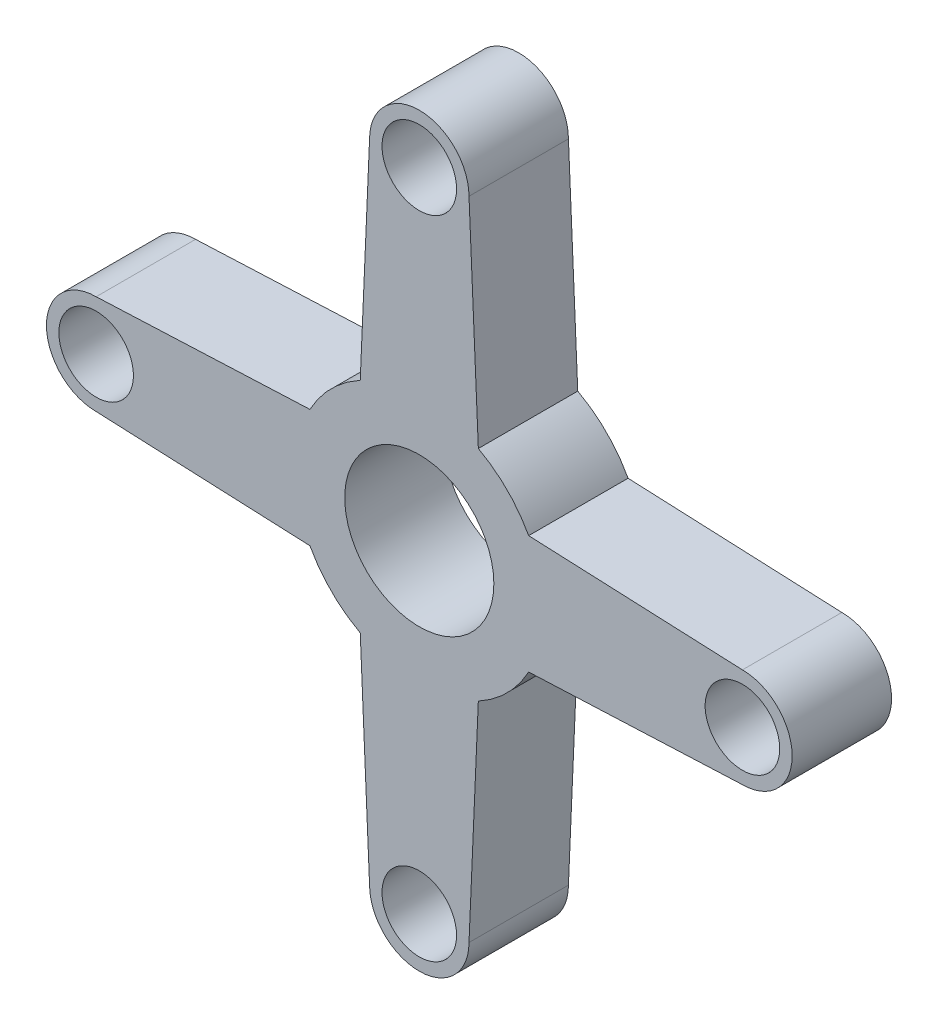
ISO-10303-21;
HEADER;
FILE_DESCRIPTION(('STEP AP214'),'2;1');
FILE_NAME('part.step','',(''),(''),'','','');
FILE_SCHEMA(('AUTOMOTIVE_DESIGN { 1 0 10303 214 1 1 1 1 }'));
ENDSEC;
DATA;
#1=APPLICATION_CONTEXT('core data for automotive mechanical design processes');
#2=APPLICATION_PROTOCOL_DEFINITION('international standard','automotive_design',2000,#1);
#3=PRODUCT_CONTEXT('',#1,'mechanical');
#4=PRODUCT('Part','Part','',(#3));
#5=PRODUCT_RELATED_PRODUCT_CATEGORY('part','',(#4));
#6=PRODUCT_DEFINITION_FORMATION('','',#4);
#7=PRODUCT_DEFINITION_CONTEXT('part definition',#1,'design');
#8=PRODUCT_DEFINITION('design','',#6,#7);
#9=PRODUCT_DEFINITION_SHAPE('','',#8);
#10=(LENGTH_UNIT() NAMED_UNIT(*) SI_UNIT(.MILLI.,.METRE.));
#11=(NAMED_UNIT(*) PLANE_ANGLE_UNIT() SI_UNIT($,.RADIAN.));
#12=(NAMED_UNIT(*) SI_UNIT($,.STERADIAN.) SOLID_ANGLE_UNIT());
#13=UNCERTAINTY_MEASURE_WITH_UNIT(LENGTH_MEASURE(1.E-05),#10,'distance_accuracy_value','');
#14=(GEOMETRIC_REPRESENTATION_CONTEXT(3) GLOBAL_UNCERTAINTY_ASSIGNED_CONTEXT((#13)) GLOBAL_UNIT_ASSIGNED_CONTEXT((#10,
#11,#12)) REPRESENTATION_CONTEXT('',''));
#15=CARTESIAN_POINT('',(0.,0.,0.));
#16=DIRECTION('',(0.,0.,1.));
#17=DIRECTION('',(1.,0.,0.));
#18=AXIS2_PLACEMENT_3D('',#15,#16,#17);
#19=CARTESIAN_POINT('',(0.,13.,4.));
#20=DIRECTION('',(0.,0.,1.));
#21=DIRECTION('',(1.,0.,0.));
#22=AXIS2_PLACEMENT_3D('',#19,#20,#21);
#23=PLANE('',#22);
#24=CARTESIAN_POINT('',(0.,-13.,4.));
#25=DIRECTION('',(0.,0.,1.));
#26=DIRECTION('',(1.,0.,0.));
#27=AXIS2_PLACEMENT_3D('',#24,#25,#26);
#28=CIRCLE('',#27,1.5);
#29=CARTESIAN_POINT('',(1.50000000000001,-13.,4.));
#30=VERTEX_POINT('',#29);
#31=EDGE_CURVE('E347',#30,#30,#28,.T.);
#32=ORIENTED_EDGE('',*,*,#31,.F.);
#33=EDGE_LOOP('',(#32));
#34=FACE_BOUND('',#33,.T.);
#35=CARTESIAN_POINT('',(0.,13.,4.));
#36=DIRECTION('',(0.,0.,1.));
#37=DIRECTION('',(1.,0.,0.));
#38=AXIS2_PLACEMENT_3D('',#35,#36,#37);
#39=CIRCLE('',#38,1.5);
#40=CARTESIAN_POINT('',(1.5,13.,4.));
#41=VERTEX_POINT('',#40);
#42=EDGE_CURVE('E359',#41,#41,#39,.T.);
#43=ORIENTED_EDGE('',*,*,#42,.F.);
#44=EDGE_LOOP('',(#43));
#45=FACE_BOUND('',#44,.T.);
#46=CARTESIAN_POINT('',(0.,13.,4.));
#47=DIRECTION('',(0.,0.,1.));
#48=DIRECTION('',(1.,0.,0.));
#49=AXIS2_PLACEMENT_3D('',#46,#47,#48);
#50=CIRCLE('',#49,2.);
#51=CARTESIAN_POINT('',(2.,13.,4.));
#52=VERTEX_POINT('',#51);
#53=CARTESIAN_POINT('',(-2.,13.,4.));
#54=VERTEX_POINT('',#53);
#55=EDGE_CURVE('E209',#52,#54,#50,.T.);
#56=ORIENTED_EDGE('',*,*,#55,.T.);
#57=DIRECTION('',(-0.043619387365329,-0.999048221581858,0.));
#58=VECTOR('',#57,1.);
#59=CARTESIAN_POINT('',(-2.,13.,4.));
#60=LINE('',#59,#58);
#61=CARTESIAN_POINT('',(-2.37549897098486,4.39965960488421,4.));
#62=VERTEX_POINT('',#61);
#63=EDGE_CURVE('E117',#54,#62,#60,.T.);
#64=ORIENTED_EDGE('',*,*,#63,.T.);
#65=CARTESIAN_POINT('',(0.,0.,4.));
#66=DIRECTION('',(0.,0.,1.));
#67=DIRECTION('',(1.,0.,0.));
#68=AXIS2_PLACEMENT_3D('',#65,#66,#67);
#69=CIRCLE('',#68,5.);
#70=CARTESIAN_POINT('',(-4.39965960488421,2.37549897098486,4.));
#71=VERTEX_POINT('',#70);
#72=EDGE_CURVE('E248',#62,#71,#69,.T.);
#73=ORIENTED_EDGE('',*,*,#72,.T.);
#74=DIRECTION('',(-0.999048221581858,-0.0436193873653292,0.));
#75=VECTOR('',#74,1.);
#76=CARTESIAN_POINT('',(-13.,2.,4.));
#77=LINE('',#76,#75);
#78=CARTESIAN_POINT('',(-13.,2.,4.));
#79=VERTEX_POINT('',#78);
#80=EDGE_CURVE('E267',#71,#79,#77,.T.);
#81=ORIENTED_EDGE('',*,*,#80,.T.);
#82=CARTESIAN_POINT('',(-13.,0.,4.));
#83=DIRECTION('',(0.,0.,1.));
#84=DIRECTION('',(1.,0.,0.));
#85=AXIS2_PLACEMENT_3D('',#82,#83,#84);
#86=CIRCLE('',#85,2.);
#87=CARTESIAN_POINT('',(-13.,-2.,4.));
#88=VERTEX_POINT('',#87);
#89=EDGE_CURVE('E264',#79,#88,#86,.T.);
#90=ORIENTED_EDGE('',*,*,#89,.T.);
#91=DIRECTION('',(0.999048221581858,-0.0436193873653288,0.));
#92=VECTOR('',#91,1.);
#93=CARTESIAN_POINT('',(-13.,-2.,4.));
#94=LINE('',#93,#92);
#95=CARTESIAN_POINT('',(-4.39965960488421,-2.37549897098486,4.));
#96=VERTEX_POINT('',#95);
#97=EDGE_CURVE('E266',#88,#96,#94,.T.);
#98=ORIENTED_EDGE('',*,*,#97,.T.);
#99=CARTESIAN_POINT('',(0.,0.,4.));
#100=DIRECTION('',(0.,0.,1.));
#101=DIRECTION('',(1.,0.,0.));
#102=AXIS2_PLACEMENT_3D('',#99,#100,#101);
#103=CIRCLE('',#102,5.);
#104=CARTESIAN_POINT('',(-2.37549897098486,-4.39965960488421,4.));
#105=VERTEX_POINT('',#104);
#106=EDGE_CURVE('E269',#96,#105,#103,.T.);
#107=ORIENTED_EDGE('',*,*,#106,.T.);
#108=DIRECTION('',(0.0436193873653291,-0.999048221581858,0.));
#109=VECTOR('',#108,1.);
#110=CARTESIAN_POINT('',(-2.,-13.,4.));
#111=LINE('',#110,#109);
#112=CARTESIAN_POINT('',(-2.,-13.,4.));
#113=VERTEX_POINT('',#112);
#114=EDGE_CURVE('E275',#105,#113,#111,.T.);
#115=ORIENTED_EDGE('',*,*,#114,.T.);
#116=CARTESIAN_POINT('',(0.,-13.,4.));
#117=DIRECTION('',(0.,0.,1.));
#118=DIRECTION('',(1.,0.,0.));
#119=AXIS2_PLACEMENT_3D('',#116,#117,#118);
#120=CIRCLE('',#119,2.);
#121=CARTESIAN_POINT('',(2.,-13.,4.));
#122=VERTEX_POINT('',#121);
#123=EDGE_CURVE('E277',#113,#122,#120,.T.);
#124=ORIENTED_EDGE('',*,*,#123,.T.);
#125=DIRECTION('',(0.0436193873653288,0.999048221581858,0.));
#126=VECTOR('',#125,1.);
#127=CARTESIAN_POINT('',(2.,-13.,4.));
#128=LINE('',#127,#126);
#129=CARTESIAN_POINT('',(2.37549897098486,-4.39965960488421,4.));
#130=VERTEX_POINT('',#129);
#131=EDGE_CURVE('E279',#122,#130,#128,.T.);
#132=ORIENTED_EDGE('',*,*,#131,.T.);
#133=CARTESIAN_POINT('',(0.,0.,4.));
#134=DIRECTION('',(0.,0.,1.));
#135=DIRECTION('',(1.,0.,0.));
#136=AXIS2_PLACEMENT_3D('',#133,#134,#135);
#137=CIRCLE('',#136,5.);
#138=CARTESIAN_POINT('',(4.39965960488421,-2.37549897098486,4.));
#139=VERTEX_POINT('',#138);
#140=EDGE_CURVE('E281',#130,#139,#137,.T.);
#141=ORIENTED_EDGE('',*,*,#140,.T.);
#142=DIRECTION('',(0.999048221581858,0.043619387365329,0.));
#143=VECTOR('',#142,1.);
#144=CARTESIAN_POINT('',(13.,-2.,4.));
#145=LINE('',#144,#143);
#146=CARTESIAN_POINT('',(13.,-2.,4.));
#147=VERTEX_POINT('',#146);
#148=EDGE_CURVE('E283',#139,#147,#145,.T.);
#149=ORIENTED_EDGE('',*,*,#148,.T.);
#150=CARTESIAN_POINT('',(13.,0.,4.));
#151=DIRECTION('',(0.,0.,1.));
#152=DIRECTION('',(1.,0.,0.));
#153=AXIS2_PLACEMENT_3D('',#150,#151,#152);
#154=CIRCLE('',#153,2.);
#155=CARTESIAN_POINT('',(13.,2.,4.));
#156=VERTEX_POINT('',#155);
#157=EDGE_CURVE('E160',#147,#156,#154,.T.);
#158=ORIENTED_EDGE('',*,*,#157,.T.);
#159=DIRECTION('',(-0.999048221581858,0.0436193873653289,0.));
#160=VECTOR('',#159,1.);
#161=CARTESIAN_POINT('',(13.,2.,4.));
#162=LINE('',#161,#160);
#163=CARTESIAN_POINT('',(4.39965960488421,2.37549897098486,4.));
#164=VERTEX_POINT('',#163);
#165=EDGE_CURVE('E154',#156,#164,#162,.T.);
#166=ORIENTED_EDGE('',*,*,#165,.T.);
#167=CARTESIAN_POINT('',(0.,0.,4.));
#168=DIRECTION('',(0.,0.,1.));
#169=DIRECTION('',(1.,0.,0.));
#170=AXIS2_PLACEMENT_3D('',#167,#168,#169);
#171=CIRCLE('',#170,5.);
#172=CARTESIAN_POINT('',(2.37549897098486,4.39965960488421,4.));
#173=VERTEX_POINT('',#172);
#174=EDGE_CURVE('E158',#164,#173,#171,.T.);
#175=ORIENTED_EDGE('',*,*,#174,.T.);
#176=DIRECTION('',(-0.0436193873653289,0.999048221581858,0.));
#177=VECTOR('',#176,1.);
#178=CARTESIAN_POINT('',(2.,13.,4.));
#179=LINE('',#178,#177);
#180=EDGE_CURVE('E50',#173,#52,#179,.T.);
#181=ORIENTED_EDGE('',*,*,#180,.T.);
#182=EDGE_LOOP('',(#56,#64,#73,#81,#90,#98,#107,#115,#124,#132,#141,#149,#158,#166,#175,#181));
#183=FACE_BOUND('',#182,.T.);
#184=CARTESIAN_POINT('',(0.,0.,4.));
#185=DIRECTION('',(0.,0.,1.));
#186=DIRECTION('',(1.,0.,0.));
#187=AXIS2_PLACEMENT_3D('',#184,#185,#186);
#188=CIRCLE('',#187,3.);
#189=CARTESIAN_POINT('',(3.,0.,4.));
#190=VERTEX_POINT('',#189);
#191=EDGE_CURVE('E182',#190,#190,#188,.T.);
#192=ORIENTED_EDGE('',*,*,#191,.F.);
#193=EDGE_LOOP('',(#192));
#194=FACE_BOUND('',#193,.T.);
#195=CARTESIAN_POINT('',(13.,0.,4.));
#196=DIRECTION('',(0.,0.,1.));
#197=DIRECTION('',(1.,0.,0.));
#198=AXIS2_PLACEMENT_3D('',#195,#196,#197);
#199=CIRCLE('',#198,1.5);
#200=CARTESIAN_POINT('',(14.5,0.,4.));
#201=VERTEX_POINT('',#200);
#202=EDGE_CURVE('E353',#201,#201,#199,.T.);
#203=ORIENTED_EDGE('',*,*,#202,.F.);
#204=EDGE_LOOP('',(#203));
#205=FACE_BOUND('',#204,.T.);
#206=CARTESIAN_POINT('',(-13.,0.,4.));
#207=DIRECTION('',(0.,0.,1.));
#208=DIRECTION('',(1.,0.,0.));
#209=AXIS2_PLACEMENT_3D('',#206,#207,#208);
#210=CIRCLE('',#209,1.5);
#211=CARTESIAN_POINT('',(-11.5,0.,4.));
#212=VERTEX_POINT('',#211);
#213=EDGE_CURVE('E338',#212,#212,#210,.T.);
#214=ORIENTED_EDGE('',*,*,#213,.F.);
#215=EDGE_LOOP('',(#214));
#216=FACE_BOUND('',#215,.T.);
#217=ADVANCED_FACE('F33',(#34,#45,#183,#194,#205,#216),#23,.T.);
#218=CARTESIAN_POINT('',(0.,13.,0.));
#219=DIRECTION('',(0.,0.,1.));
#220=DIRECTION('',(1.,0.,0.));
#221=AXIS2_PLACEMENT_3D('',#218,#219,#220);
#222=PLANE('',#221);
#223=CARTESIAN_POINT('',(0.,13.,0.));
#224=DIRECTION('',(0.,0.,1.));
#225=DIRECTION('',(1.,0.,0.));
#226=AXIS2_PLACEMENT_3D('',#223,#224,#225);
#227=CIRCLE('',#226,2.);
#228=CARTESIAN_POINT('',(2.,13.,0.));
#229=VERTEX_POINT('',#228);
#230=CARTESIAN_POINT('',(-2.,13.,0.));
#231=VERTEX_POINT('',#230);
#232=EDGE_CURVE('E178',#229,#231,#227,.T.);
#233=ORIENTED_EDGE('',*,*,#232,.F.);
#234=DIRECTION('',(-0.0436193873653289,0.999048221581858,0.));
#235=VECTOR('',#234,1.);
#236=CARTESIAN_POINT('',(2.,13.,0.));
#237=LINE('',#236,#235);
#238=CARTESIAN_POINT('',(2.37549897098486,4.39965960488421,0.));
#239=VERTEX_POINT('',#238);
#240=EDGE_CURVE('E109',#239,#229,#237,.T.);
#241=ORIENTED_EDGE('',*,*,#240,.F.);
#242=CARTESIAN_POINT('',(0.,0.,0.));
#243=DIRECTION('',(0.,0.,1.));
#244=DIRECTION('',(1.,0.,0.));
#245=AXIS2_PLACEMENT_3D('',#242,#243,#244);
#246=CIRCLE('',#245,5.);
#247=CARTESIAN_POINT('',(4.39965960488421,2.37549897098486,0.));
#248=VERTEX_POINT('',#247);
#249=EDGE_CURVE('E103',#248,#239,#246,.T.);
#250=ORIENTED_EDGE('',*,*,#249,.F.);
#251=DIRECTION('',(-0.999048221581858,0.0436193873653289,0.));
#252=VECTOR('',#251,1.);
#253=CARTESIAN_POINT('',(13.,2.,0.));
#254=LINE('',#253,#252);
#255=CARTESIAN_POINT('',(13.,2.,0.));
#256=VERTEX_POINT('',#255);
#257=EDGE_CURVE('E168',#256,#248,#254,.T.);
#258=ORIENTED_EDGE('',*,*,#257,.F.);
#259=CARTESIAN_POINT('',(13.,0.,0.));
#260=DIRECTION('',(0.,0.,1.));
#261=DIRECTION('',(1.,0.,0.));
#262=AXIS2_PLACEMENT_3D('',#259,#260,#261);
#263=CIRCLE('',#262,2.);
#264=CARTESIAN_POINT('',(13.,-2.,0.));
#265=VERTEX_POINT('',#264);
#266=EDGE_CURVE('E204',#265,#256,#263,.T.);
#267=ORIENTED_EDGE('',*,*,#266,.F.);
#268=DIRECTION('',(0.999048221581858,0.043619387365329,0.));
#269=VECTOR('',#268,1.);
#270=CARTESIAN_POINT('',(13.,-2.,0.));
#271=LINE('',#270,#269);
#272=CARTESIAN_POINT('',(4.39965960488421,-2.37549897098486,0.));
#273=VERTEX_POINT('',#272);
#274=EDGE_CURVE('E202',#273,#265,#271,.T.);
#275=ORIENTED_EDGE('',*,*,#274,.F.);
#276=CARTESIAN_POINT('',(0.,0.,0.));
#277=DIRECTION('',(0.,0.,1.));
#278=DIRECTION('',(1.,0.,0.));
#279=AXIS2_PLACEMENT_3D('',#276,#277,#278);
#280=CIRCLE('',#279,5.);
#281=CARTESIAN_POINT('',(2.37549897098486,-4.39965960488421,0.));
#282=VERTEX_POINT('',#281);
#283=EDGE_CURVE('E200',#282,#273,#280,.T.);
#284=ORIENTED_EDGE('',*,*,#283,.F.);
#285=DIRECTION('',(0.0436193873653288,0.999048221581858,0.));
#286=VECTOR('',#285,1.);
#287=CARTESIAN_POINT('',(2.,-13.,0.));
#288=LINE('',#287,#286);
#289=CARTESIAN_POINT('',(2.,-13.,0.));
#290=VERTEX_POINT('',#289);
#291=EDGE_CURVE('E198',#290,#282,#288,.T.);
#292=ORIENTED_EDGE('',*,*,#291,.F.);
#293=CARTESIAN_POINT('',(0.,-13.,0.));
#294=DIRECTION('',(0.,0.,1.));
#295=DIRECTION('',(1.,0.,0.));
#296=AXIS2_PLACEMENT_3D('',#293,#294,#295);
#297=CIRCLE('',#296,2.);
#298=CARTESIAN_POINT('',(-2.,-13.,0.));
#299=VERTEX_POINT('',#298);
#300=EDGE_CURVE('E196',#299,#290,#297,.T.);
#301=ORIENTED_EDGE('',*,*,#300,.F.);
#302=DIRECTION('',(0.0436193873653291,-0.999048221581858,0.));
#303=VECTOR('',#302,1.);
#304=CARTESIAN_POINT('',(-2.,-13.,0.));
#305=LINE('',#304,#303);
#306=CARTESIAN_POINT('',(-2.37549897098486,-4.39965960488421,0.));
#307=VERTEX_POINT('',#306);
#308=EDGE_CURVE('E194',#307,#299,#305,.T.);
#309=ORIENTED_EDGE('',*,*,#308,.F.);
#310=CARTESIAN_POINT('',(0.,0.,0.));
#311=DIRECTION('',(0.,0.,1.));
#312=DIRECTION('',(1.,0.,0.));
#313=AXIS2_PLACEMENT_3D('',#310,#311,#312);
#314=CIRCLE('',#313,5.);
#315=CARTESIAN_POINT('',(-4.39965960488421,-2.37549897098486,0.));
#316=VERTEX_POINT('',#315);
#317=EDGE_CURVE('E192',#316,#307,#314,.T.);
#318=ORIENTED_EDGE('',*,*,#317,.F.);
#319=DIRECTION('',(0.999048221581858,-0.0436193873653288,0.));
#320=VECTOR('',#319,1.);
#321=CARTESIAN_POINT('',(-13.,-2.,0.));
#322=LINE('',#321,#320);
#323=CARTESIAN_POINT('',(-13.,-2.,0.));
#324=VERTEX_POINT('',#323);
#325=EDGE_CURVE('E190',#324,#316,#322,.T.);
#326=ORIENTED_EDGE('',*,*,#325,.F.);
#327=CARTESIAN_POINT('',(-13.,0.,0.));
#328=DIRECTION('',(0.,0.,1.));
#329=DIRECTION('',(1.,0.,0.));
#330=AXIS2_PLACEMENT_3D('',#327,#328,#329);
#331=CIRCLE('',#330,2.);
#332=CARTESIAN_POINT('',(-13.,2.,0.));
#333=VERTEX_POINT('',#332);
#334=EDGE_CURVE('E188',#333,#324,#331,.T.);
#335=ORIENTED_EDGE('',*,*,#334,.F.);
#336=DIRECTION('',(-0.999048221581858,-0.0436193873653292,0.));
#337=VECTOR('',#336,1.);
#338=CARTESIAN_POINT('',(-13.,2.,0.));
#339=LINE('',#338,#337);
#340=CARTESIAN_POINT('',(-4.39965960488421,2.37549897098486,0.));
#341=VERTEX_POINT('',#340);
#342=EDGE_CURVE('E186',#341,#333,#339,.T.);
#343=ORIENTED_EDGE('',*,*,#342,.F.);
#344=CARTESIAN_POINT('',(0.,0.,0.));
#345=DIRECTION('',(0.,0.,1.));
#346=DIRECTION('',(1.,0.,0.));
#347=AXIS2_PLACEMENT_3D('',#344,#345,#346);
#348=CIRCLE('',#347,5.);
#349=CARTESIAN_POINT('',(-2.37549897098486,4.39965960488421,0.));
#350=VERTEX_POINT('',#349);
#351=EDGE_CURVE('E184',#350,#341,#348,.T.);
#352=ORIENTED_EDGE('',*,*,#351,.F.);
#353=DIRECTION('',(-0.043619387365329,-0.999048221581858,0.));
#354=VECTOR('',#353,1.);
#355=CARTESIAN_POINT('',(-2.,13.,0.));
#356=LINE('',#355,#354);
#357=EDGE_CURVE('E181',#231,#350,#356,.T.);
#358=ORIENTED_EDGE('',*,*,#357,.F.);
#359=EDGE_LOOP('',(#233,#241,#250,#258,#267,#275,#284,#292,#301,#309,#318,#326,#335,#343,#352,#358));
#360=FACE_BOUND('',#359,.T.);
#361=CARTESIAN_POINT('',(0.,0.,0.));
#362=DIRECTION('',(0.,0.,1.));
#363=DIRECTION('',(1.,0.,0.));
#364=AXIS2_PLACEMENT_3D('',#361,#362,#363);
#365=CIRCLE('',#364,3.);
#366=CARTESIAN_POINT('',(3.,0.,0.));
#367=VERTEX_POINT('',#366);
#368=EDGE_CURVE('E362',#367,#367,#365,.T.);
#369=ORIENTED_EDGE('',*,*,#368,.T.);
#370=EDGE_LOOP('',(#369));
#371=FACE_BOUND('',#370,.T.);
#372=CARTESIAN_POINT('',(0.,13.,0.));
#373=DIRECTION('',(0.,0.,1.));
#374=DIRECTION('',(1.,0.,0.));
#375=AXIS2_PLACEMENT_3D('',#372,#373,#374);
#376=CIRCLE('',#375,1.5);
#377=CARTESIAN_POINT('',(1.5,13.,0.));
#378=VERTEX_POINT('',#377);
#379=EDGE_CURVE('E356',#378,#378,#376,.T.);
#380=ORIENTED_EDGE('',*,*,#379,.T.);
#381=EDGE_LOOP('',(#380));
#382=FACE_BOUND('',#381,.T.);
#383=CARTESIAN_POINT('',(13.,0.,0.));
#384=DIRECTION('',(0.,0.,1.));
#385=DIRECTION('',(1.,0.,0.));
#386=AXIS2_PLACEMENT_3D('',#383,#384,#385);
#387=CIRCLE('',#386,1.5);
#388=CARTESIAN_POINT('',(14.5,0.,0.));
#389=VERTEX_POINT('',#388);
#390=EDGE_CURVE('E350',#389,#389,#387,.T.);
#391=ORIENTED_EDGE('',*,*,#390,.T.);
#392=EDGE_LOOP('',(#391));
#393=FACE_BOUND('',#392,.T.);
#394=CARTESIAN_POINT('',(0.,-13.,0.));
#395=DIRECTION('',(0.,0.,1.));
#396=DIRECTION('',(1.,0.,0.));
#397=AXIS2_PLACEMENT_3D('',#394,#395,#396);
#398=CIRCLE('',#397,1.5);
#399=CARTESIAN_POINT('',(1.50000000000001,-13.,0.));
#400=VERTEX_POINT('',#399);
#401=EDGE_CURVE('E344',#400,#400,#398,.T.);
#402=ORIENTED_EDGE('',*,*,#401,.T.);
#403=EDGE_LOOP('',(#402));
#404=FACE_BOUND('',#403,.T.);
#405=CARTESIAN_POINT('',(-13.,0.,0.));
#406=DIRECTION('',(0.,0.,1.));
#407=DIRECTION('',(1.,0.,0.));
#408=AXIS2_PLACEMENT_3D('',#405,#406,#407);
#409=CIRCLE('',#408,1.5);
#410=CARTESIAN_POINT('',(-11.5,0.,0.));
#411=VERTEX_POINT('',#410);
#412=EDGE_CURVE('E341',#411,#411,#409,.T.);
#413=ORIENTED_EDGE('',*,*,#412,.T.);
#414=EDGE_LOOP('',(#413));
#415=FACE_BOUND('',#414,.T.);
#416=ADVANCED_FACE('F252',(#360,#371,#382,#393,#404,#415),#222,.F.);
#417=CARTESIAN_POINT('',(0.,13.,4.));
#418=DIRECTION('',(0.,0.,-1.));
#419=DIRECTION('',(-1.,0.,0.));
#420=AXIS2_PLACEMENT_3D('',#417,#418,#419);
#421=CYLINDRICAL_SURFACE('',#420,2.);
#422=ORIENTED_EDGE('',*,*,#232,.T.);
#423=DIRECTION('',(0.,0.,-1.));
#424=VECTOR('',#423,1.);
#425=CARTESIAN_POINT('',(-2.,13.,4.));
#426=LINE('',#425,#424);
#427=EDGE_CURVE('E11',#54,#231,#426,.T.);
#428=ORIENTED_EDGE('',*,*,#427,.F.);
#429=ORIENTED_EDGE('',*,*,#55,.F.);
#430=DIRECTION('',(0.,0.,-1.));
#431=VECTOR('',#430,1.);
#432=CARTESIAN_POINT('',(2.,13.,4.));
#433=LINE('',#432,#431);
#434=EDGE_CURVE('E174',#52,#229,#433,.T.);
#435=ORIENTED_EDGE('',*,*,#434,.T.);
#436=EDGE_LOOP('',(#422,#428,#429,#435));
#437=FACE_BOUND('',#436,.T.);
#438=ADVANCED_FACE('F35',(#437),#421,.T.);
#439=CARTESIAN_POINT('',(-2.,13.,4.));
#440=DIRECTION('',(0.999048221581858,-0.043619387365329,0.));
#441=DIRECTION('',(0.043619387365329,0.999048221581858,0.));
#442=AXIS2_PLACEMENT_3D('',#439,#440,#441);
#443=PLANE('',#442);
#444=ORIENTED_EDGE('',*,*,#357,.T.);
#445=DIRECTION('',(0.,0.,-1.));
#446=VECTOR('',#445,1.);
#447=CARTESIAN_POINT('',(-2.37549897098486,4.39965960488421,4.));
#448=LINE('',#447,#446);
#449=EDGE_CURVE('E42',#62,#350,#448,.T.);
#450=ORIENTED_EDGE('',*,*,#449,.F.);
#451=ORIENTED_EDGE('',*,*,#63,.F.);
#452=ORIENTED_EDGE('',*,*,#427,.T.);
#453=EDGE_LOOP('',(#444,#450,#451,#452));
#454=FACE_BOUND('',#453,.T.);
#455=ADVANCED_FACE('F521',(#454),#443,.F.);
#456=CARTESIAN_POINT('',(0.,0.,4.));
#457=DIRECTION('',(0.,0.,-1.));
#458=DIRECTION('',(-1.,0.,0.));
#459=AXIS2_PLACEMENT_3D('',#456,#457,#458);
#460=CYLINDRICAL_SURFACE('',#459,5.);
#461=ORIENTED_EDGE('',*,*,#351,.T.);
#462=DIRECTION('',(0.,0.,-1.));
#463=VECTOR('',#462,1.);
#464=CARTESIAN_POINT('',(-4.39965960488421,2.37549897098486,4.));
#465=LINE('',#464,#463);
#466=EDGE_CURVE('E240',#71,#341,#465,.T.);
#467=ORIENTED_EDGE('',*,*,#466,.F.);
#468=ORIENTED_EDGE('',*,*,#72,.F.);
#469=ORIENTED_EDGE('',*,*,#449,.T.);
#470=EDGE_LOOP('',(#461,#467,#468,#469));
#471=FACE_BOUND('',#470,.T.);
#472=ADVANCED_FACE('F246',(#471),#460,.T.);
#473=CARTESIAN_POINT('',(-13.,2.,4.));
#474=DIRECTION('',(0.0436193873653292,-0.999048221581858,0.));
#475=DIRECTION('',(0.999048221581858,0.0436193873653292,0.));
#476=AXIS2_PLACEMENT_3D('',#473,#474,#475);
#477=PLANE('',#476);
#478=ORIENTED_EDGE('',*,*,#342,.T.);
#479=DIRECTION('',(0.,0.,-1.));
#480=VECTOR('',#479,1.);
#481=CARTESIAN_POINT('',(-13.,2.,4.));
#482=LINE('',#481,#480);
#483=EDGE_CURVE('E237',#79,#333,#482,.T.);
#484=ORIENTED_EDGE('',*,*,#483,.F.);
#485=ORIENTED_EDGE('',*,*,#80,.F.);
#486=ORIENTED_EDGE('',*,*,#466,.T.);
#487=EDGE_LOOP('',(#478,#484,#485,#486));
#488=FACE_BOUND('',#487,.T.);
#489=ADVANCED_FACE('F258',(#488),#477,.F.);
#490=CARTESIAN_POINT('',(-13.,0.,4.));
#491=DIRECTION('',(0.,0.,-1.));
#492=DIRECTION('',(-1.,0.,0.));
#493=AXIS2_PLACEMENT_3D('',#490,#491,#492);
#494=CYLINDRICAL_SURFACE('',#493,2.);
#495=ORIENTED_EDGE('',*,*,#334,.T.);
#496=DIRECTION('',(0.,0.,-1.));
#497=VECTOR('',#496,1.);
#498=CARTESIAN_POINT('',(-13.,-2.,4.));
#499=LINE('',#498,#497);
#500=EDGE_CURVE('E234',#88,#324,#499,.T.);
#501=ORIENTED_EDGE('',*,*,#500,.F.);
#502=ORIENTED_EDGE('',*,*,#89,.F.);
#503=ORIENTED_EDGE('',*,*,#483,.T.);
#504=EDGE_LOOP('',(#495,#501,#502,#503));
#505=FACE_BOUND('',#504,.T.);
#506=ADVANCED_FACE('F262',(#505),#494,.T.);
#507=CARTESIAN_POINT('',(-13.,-2.,4.));
#508=DIRECTION('',(0.0436193873653288,0.999048221581858,0.));
#509=DIRECTION('',(-0.999048221581858,0.0436193873653288,0.));
#510=AXIS2_PLACEMENT_3D('',#507,#508,#509);
#511=PLANE('',#510);
#512=ORIENTED_EDGE('',*,*,#325,.T.);
#513=DIRECTION('',(0.,0.,-1.));
#514=VECTOR('',#513,1.);
#515=CARTESIAN_POINT('',(-4.39965960488421,-2.37549897098486,4.));
#516=LINE('',#515,#514);
#517=EDGE_CURVE('E231',#96,#316,#516,.T.);
#518=ORIENTED_EDGE('',*,*,#517,.F.);
#519=ORIENTED_EDGE('',*,*,#97,.F.);
#520=ORIENTED_EDGE('',*,*,#500,.T.);
#521=EDGE_LOOP('',(#512,#518,#519,#520));
#522=FACE_BOUND('',#521,.T.);
#523=ADVANCED_FACE('F486',(#522),#511,.F.);
#524=CARTESIAN_POINT('',(0.,0.,4.));
#525=DIRECTION('',(0.,0.,-1.));
#526=DIRECTION('',(-1.,0.,0.));
#527=AXIS2_PLACEMENT_3D('',#524,#525,#526);
#528=CYLINDRICAL_SURFACE('',#527,5.);
#529=ORIENTED_EDGE('',*,*,#317,.T.);
#530=DIRECTION('',(0.,0.,-1.));
#531=VECTOR('',#530,1.);
#532=CARTESIAN_POINT('',(-2.37549897098486,-4.39965960488421,4.));
#533=LINE('',#532,#531);
#534=EDGE_CURVE('E228',#105,#307,#533,.T.);
#535=ORIENTED_EDGE('',*,*,#534,.F.);
#536=ORIENTED_EDGE('',*,*,#106,.F.);
#537=ORIENTED_EDGE('',*,*,#517,.T.);
#538=EDGE_LOOP('',(#529,#535,#536,#537));
#539=FACE_BOUND('',#538,.T.);
#540=ADVANCED_FACE('F476',(#539),#528,.T.);
#541=CARTESIAN_POINT('',(-2.,-13.,4.));
#542=DIRECTION('',(0.999048221581858,0.0436193873653291,0.));
#543=DIRECTION('',(-0.0436193873653291,0.999048221581858,0.));
#544=AXIS2_PLACEMENT_3D('',#541,#542,#543);
#545=PLANE('',#544);
#546=ORIENTED_EDGE('',*,*,#308,.T.);
#547=DIRECTION('',(0.,0.,-1.));
#548=VECTOR('',#547,1.);
#549=CARTESIAN_POINT('',(-2.,-13.,4.));
#550=LINE('',#549,#548);
#551=EDGE_CURVE('E225',#113,#299,#550,.T.);
#552=ORIENTED_EDGE('',*,*,#551,.F.);
#553=ORIENTED_EDGE('',*,*,#114,.F.);
#554=ORIENTED_EDGE('',*,*,#534,.T.);
#555=EDGE_LOOP('',(#546,#552,#553,#554));
#556=FACE_BOUND('',#555,.T.);
#557=ADVANCED_FACE('F466',(#556),#545,.F.);
#558=CARTESIAN_POINT('',(0.,-13.,4.));
#559=DIRECTION('',(0.,0.,-1.));
#560=DIRECTION('',(-1.,0.,0.));
#561=AXIS2_PLACEMENT_3D('',#558,#559,#560);
#562=CYLINDRICAL_SURFACE('',#561,2.);
#563=ORIENTED_EDGE('',*,*,#300,.T.);
#564=DIRECTION('',(0.,0.,-1.));
#565=VECTOR('',#564,1.);
#566=CARTESIAN_POINT('',(2.,-13.,4.));
#567=LINE('',#566,#565);
#568=EDGE_CURVE('E222',#122,#290,#567,.T.);
#569=ORIENTED_EDGE('',*,*,#568,.F.);
#570=ORIENTED_EDGE('',*,*,#123,.F.);
#571=ORIENTED_EDGE('',*,*,#551,.T.);
#572=EDGE_LOOP('',(#563,#569,#570,#571));
#573=FACE_BOUND('',#572,.T.);
#574=ADVANCED_FACE('F456',(#573),#562,.T.);
#575=CARTESIAN_POINT('',(2.,-13.,4.));
#576=DIRECTION('',(-0.999048221581858,0.0436193873653288,0.));
#577=DIRECTION('',(-0.0436193873653288,-0.999048221581858,0.));
#578=AXIS2_PLACEMENT_3D('',#575,#576,#577);
#579=PLANE('',#578);
#580=ORIENTED_EDGE('',*,*,#291,.T.);
#581=DIRECTION('',(0.,0.,-1.));
#582=VECTOR('',#581,1.);
#583=CARTESIAN_POINT('',(2.37549897098486,-4.39965960488421,4.));
#584=LINE('',#583,#582);
#585=EDGE_CURVE('E219',#130,#282,#584,.T.);
#586=ORIENTED_EDGE('',*,*,#585,.F.);
#587=ORIENTED_EDGE('',*,*,#131,.F.);
#588=ORIENTED_EDGE('',*,*,#568,.T.);
#589=EDGE_LOOP('',(#580,#586,#587,#588));
#590=FACE_BOUND('',#589,.T.);
#591=ADVANCED_FACE('F446',(#590),#579,.F.);
#592=CARTESIAN_POINT('',(0.,0.,4.));
#593=DIRECTION('',(0.,0.,-1.));
#594=DIRECTION('',(-1.,0.,0.));
#595=AXIS2_PLACEMENT_3D('',#592,#593,#594);
#596=CYLINDRICAL_SURFACE('',#595,5.);
#597=ORIENTED_EDGE('',*,*,#283,.T.);
#598=DIRECTION('',(0.,0.,-1.));
#599=VECTOR('',#598,1.);
#600=CARTESIAN_POINT('',(4.39965960488421,-2.37549897098486,4.));
#601=LINE('',#600,#599);
#602=EDGE_CURVE('E216',#139,#273,#601,.T.);
#603=ORIENTED_EDGE('',*,*,#602,.F.);
#604=ORIENTED_EDGE('',*,*,#140,.F.);
#605=ORIENTED_EDGE('',*,*,#585,.T.);
#606=EDGE_LOOP('',(#597,#603,#604,#605));
#607=FACE_BOUND('',#606,.T.);
#608=ADVANCED_FACE('F437',(#607),#596,.T.);
#609=CARTESIAN_POINT('',(13.,-2.,4.));
#610=DIRECTION('',(-0.043619387365329,0.999048221581858,0.));
#611=DIRECTION('',(-0.999048221581858,-0.043619387365329,0.));
#612=AXIS2_PLACEMENT_3D('',#609,#610,#611);
#613=PLANE('',#612);
#614=ORIENTED_EDGE('',*,*,#274,.T.);
#615=DIRECTION('',(0.,0.,-1.));
#616=VECTOR('',#615,1.);
#617=CARTESIAN_POINT('',(13.,-2.,4.));
#618=LINE('',#617,#616);
#619=EDGE_CURVE('E213',#147,#265,#618,.T.);
#620=ORIENTED_EDGE('',*,*,#619,.F.);
#621=ORIENTED_EDGE('',*,*,#148,.F.);
#622=ORIENTED_EDGE('',*,*,#602,.T.);
#623=EDGE_LOOP('',(#614,#620,#621,#622));
#624=FACE_BOUND('',#623,.T.);
#625=ADVANCED_FACE('F289',(#624),#613,.F.);
#626=CARTESIAN_POINT('',(13.,0.,4.));
#627=DIRECTION('',(0.,0.,-1.));
#628=DIRECTION('',(-1.,0.,0.));
#629=AXIS2_PLACEMENT_3D('',#626,#627,#628);
#630=CYLINDRICAL_SURFACE('',#629,2.);
#631=ORIENTED_EDGE('',*,*,#266,.T.);
#632=DIRECTION('',(0.,0.,-1.));
#633=VECTOR('',#632,1.);
#634=CARTESIAN_POINT('',(13.,2.,4.));
#635=LINE('',#634,#633);
#636=EDGE_CURVE('E169',#156,#256,#635,.T.);
#637=ORIENTED_EDGE('',*,*,#636,.F.);
#638=ORIENTED_EDGE('',*,*,#157,.F.);
#639=ORIENTED_EDGE('',*,*,#619,.T.);
#640=EDGE_LOOP('',(#631,#637,#638,#639));
#641=FACE_BOUND('',#640,.T.);
#642=ADVANCED_FACE('F293',(#641),#630,.T.);
#643=CARTESIAN_POINT('',(13.,2.,4.));
#644=DIRECTION('',(-0.0436193873653289,-0.999048221581858,0.));
#645=DIRECTION('',(0.999048221581858,-0.0436193873653289,0.));
#646=AXIS2_PLACEMENT_3D('',#643,#644,#645);
#647=PLANE('',#646);
#648=ORIENTED_EDGE('',*,*,#257,.T.);
#649=DIRECTION('',(0.,0.,-1.));
#650=VECTOR('',#649,1.);
#651=CARTESIAN_POINT('',(4.39965960488421,2.37549897098486,4.));
#652=LINE('',#651,#650);
#653=EDGE_CURVE('E165',#164,#248,#652,.T.);
#654=ORIENTED_EDGE('',*,*,#653,.F.);
#655=ORIENTED_EDGE('',*,*,#165,.F.);
#656=ORIENTED_EDGE('',*,*,#636,.T.);
#657=EDGE_LOOP('',(#648,#654,#655,#656));
#658=FACE_BOUND('',#657,.T.);
#659=ADVANCED_FACE('F166',(#658),#647,.F.);
#660=CARTESIAN_POINT('',(0.,0.,4.));
#661=DIRECTION('',(0.,0.,-1.));
#662=DIRECTION('',(-1.,0.,0.));
#663=AXIS2_PLACEMENT_3D('',#660,#661,#662);
#664=CYLINDRICAL_SURFACE('',#663,5.);
#665=ORIENTED_EDGE('',*,*,#249,.T.);
#666=DIRECTION('',(0.,0.,-1.));
#667=VECTOR('',#666,1.);
#668=CARTESIAN_POINT('',(2.37549897098486,4.39965960488421,4.));
#669=LINE('',#668,#667);
#670=EDGE_CURVE('E170',#173,#239,#669,.T.);
#671=ORIENTED_EDGE('',*,*,#670,.F.);
#672=ORIENTED_EDGE('',*,*,#174,.F.);
#673=ORIENTED_EDGE('',*,*,#653,.T.);
#674=EDGE_LOOP('',(#665,#671,#672,#673));
#675=FACE_BOUND('',#674,.T.);
#676=ADVANCED_FACE('F172',(#675),#664,.T.);
#677=CARTESIAN_POINT('',(2.,13.,4.));
#678=DIRECTION('',(-0.999048221581858,-0.0436193873653289,0.));
#679=DIRECTION('',(0.0436193873653289,-0.999048221581858,0.));
#680=AXIS2_PLACEMENT_3D('',#677,#678,#679);
#681=PLANE('',#680);
#682=ORIENTED_EDGE('',*,*,#240,.T.);
#683=ORIENTED_EDGE('',*,*,#434,.F.);
#684=ORIENTED_EDGE('',*,*,#180,.F.);
#685=ORIENTED_EDGE('',*,*,#670,.T.);
#686=EDGE_LOOP('',(#682,#683,#684,#685));
#687=FACE_BOUND('',#686,.T.);
#688=ADVANCED_FACE('F297',(#687),#681,.F.);
#689=CARTESIAN_POINT('',(0.,0.,4.));
#690=DIRECTION('',(0.,0.,-1.));
#691=DIRECTION('',(-1.,0.,0.));
#692=AXIS2_PLACEMENT_3D('',#689,#690,#691);
#693=CYLINDRICAL_SURFACE('',#692,3.);
#694=ORIENTED_EDGE('',*,*,#191,.T.);
#695=EDGE_LOOP('',(#694));
#696=FACE_BOUND('',#695,.T.);
#697=ORIENTED_EDGE('',*,*,#368,.F.);
#698=EDGE_LOOP('',(#697));
#699=FACE_BOUND('',#698,.T.);
#700=ADVANCED_FACE('F299',(#696,#699),#693,.F.);
#701=CARTESIAN_POINT('',(0.,13.,4.));
#702=DIRECTION('',(0.,0.,-1.));
#703=DIRECTION('',(-1.,0.,0.));
#704=AXIS2_PLACEMENT_3D('',#701,#702,#703);
#705=CYLINDRICAL_SURFACE('',#704,1.5);
#706=ORIENTED_EDGE('',*,*,#42,.T.);
#707=EDGE_LOOP('',(#706));
#708=FACE_BOUND('',#707,.T.);
#709=ORIENTED_EDGE('',*,*,#379,.F.);
#710=EDGE_LOOP('',(#709));
#711=FACE_BOUND('',#710,.T.);
#712=ADVANCED_FACE('F305',(#708,#711),#705,.F.);
#713=CARTESIAN_POINT('',(13.,0.,4.));
#714=DIRECTION('',(0.,0.,-1.));
#715=DIRECTION('',(-1.,0.,0.));
#716=AXIS2_PLACEMENT_3D('',#713,#714,#715);
#717=CYLINDRICAL_SURFACE('',#716,1.5);
#718=ORIENTED_EDGE('',*,*,#202,.T.);
#719=EDGE_LOOP('',(#718));
#720=FACE_BOUND('',#719,.T.);
#721=ORIENTED_EDGE('',*,*,#390,.F.);
#722=EDGE_LOOP('',(#721));
#723=FACE_BOUND('',#722,.T.);
#724=ADVANCED_FACE('F321',(#720,#723),#717,.F.);
#725=CARTESIAN_POINT('',(0.,-13.,4.));
#726=DIRECTION('',(0.,0.,-1.));
#727=DIRECTION('',(-1.,0.,0.));
#728=AXIS2_PLACEMENT_3D('',#725,#726,#727);
#729=CYLINDRICAL_SURFACE('',#728,1.5);
#730=ORIENTED_EDGE('',*,*,#31,.T.);
#731=EDGE_LOOP('',(#730));
#732=FACE_BOUND('',#731,.T.);
#733=ORIENTED_EDGE('',*,*,#401,.F.);
#734=EDGE_LOOP('',(#733));
#735=FACE_BOUND('',#734,.T.);
#736=ADVANCED_FACE('F325',(#732,#735),#729,.F.);
#737=CARTESIAN_POINT('',(-13.,0.,4.));
#738=DIRECTION('',(0.,0.,-1.));
#739=DIRECTION('',(-1.,0.,0.));
#740=AXIS2_PLACEMENT_3D('',#737,#738,#739);
#741=CYLINDRICAL_SURFACE('',#740,1.5);
#742=ORIENTED_EDGE('',*,*,#213,.T.);
#743=EDGE_LOOP('',(#742));
#744=FACE_BOUND('',#743,.T.);
#745=ORIENTED_EDGE('',*,*,#412,.F.);
#746=EDGE_LOOP('',(#745));
#747=FACE_BOUND('',#746,.T.);
#748=ADVANCED_FACE('F329',(#744,#747),#741,.F.);
#749=CLOSED_SHELL('',(#217,#416,#438,#455,#472,#489,#506,#523,#540,#557,#574,#591,#608,#625,
#642,#659,#676,#688,#700,#712,#724,#736,#748));
#750=MANIFOLD_SOLID_BREP('B2',#749);
#751=ADVANCED_BREP_SHAPE_REPRESENTATION('',(#18,#750),#14);
#752=SHAPE_DEFINITION_REPRESENTATION(#9,#751);
ENDSEC;
END-ISO-10303-21;
